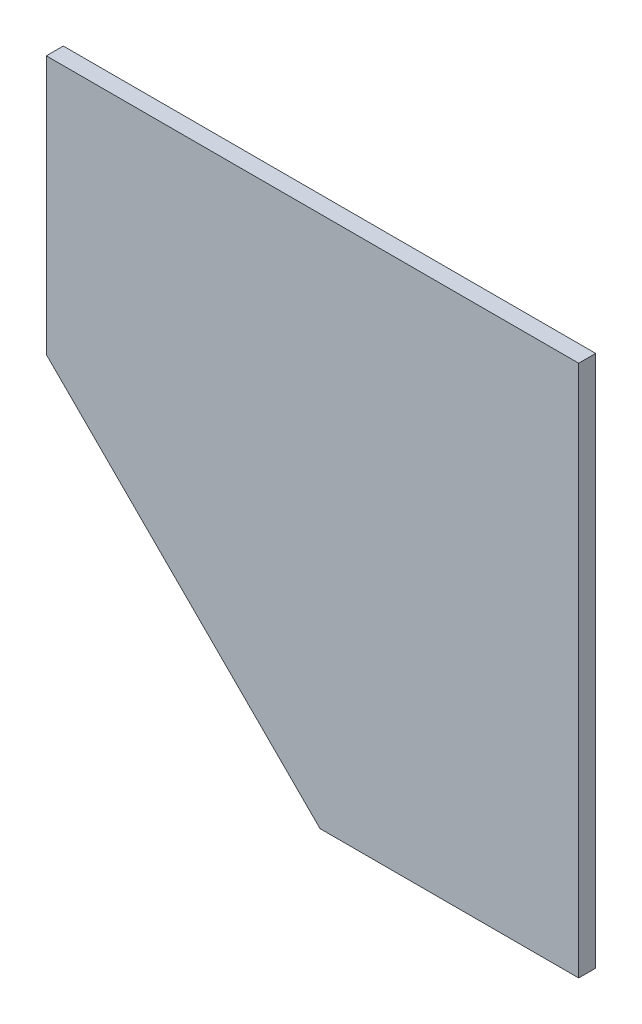
ISO-10303-21;
HEADER;
FILE_DESCRIPTION(('STEP AP214'),'2;1');
FILE_NAME('part.step','',(''),(''),'','','');
FILE_SCHEMA(('AUTOMOTIVE_DESIGN { 1 0 10303 214 1 1 1 1 }'));
ENDSEC;
DATA;
#1=APPLICATION_CONTEXT('core data for automotive mechanical design processes');
#2=APPLICATION_PROTOCOL_DEFINITION('international standard','automotive_design',2000,#1);
#3=PRODUCT_CONTEXT('',#1,'mechanical');
#4=PRODUCT('Part','Part','',(#3));
#5=PRODUCT_RELATED_PRODUCT_CATEGORY('part','',(#4));
#6=PRODUCT_DEFINITION_FORMATION('','',#4);
#7=PRODUCT_DEFINITION_CONTEXT('part definition',#1,'design');
#8=PRODUCT_DEFINITION('design','',#6,#7);
#9=PRODUCT_DEFINITION_SHAPE('','',#8);
#10=(LENGTH_UNIT() NAMED_UNIT(*) SI_UNIT(.MILLI.,.METRE.));
#11=(NAMED_UNIT(*) PLANE_ANGLE_UNIT() SI_UNIT($,.RADIAN.));
#12=(NAMED_UNIT(*) SI_UNIT($,.STERADIAN.) SOLID_ANGLE_UNIT());
#13=UNCERTAINTY_MEASURE_WITH_UNIT(LENGTH_MEASURE(1.E-05),#10,'distance_accuracy_value','');
#14=(GEOMETRIC_REPRESENTATION_CONTEXT(3) GLOBAL_UNCERTAINTY_ASSIGNED_CONTEXT((#13)) GLOBAL_UNIT_ASSIGNED_CONTEXT((#10,
#11,#12)) REPRESENTATION_CONTEXT('',''));
#15=CARTESIAN_POINT('',(0.,0.,0.));
#16=DIRECTION('',(0.,0.,1.));
#17=DIRECTION('',(1.,0.,0.));
#18=AXIS2_PLACEMENT_3D('',#15,#16,#17);
#19=CARTESIAN_POINT('',(-282.,-186.5,18.));
#20=DIRECTION('',(1.,0.,0.));
#21=DIRECTION('',(0.,1.,0.));
#22=AXIS2_PLACEMENT_3D('',#19,#20,#21);
#23=PLANE('',#22);
#24=DIRECTION('',(0.,-1.,0.));
#25=VECTOR('',#24,1.);
#26=CARTESIAN_POINT('',(-282.,-186.5,0.));
#27=LINE('',#26,#25);
#28=CARTESIAN_POINT('',(-282.,87.5,0.));
#29=VERTEX_POINT('',#28);
#30=CARTESIAN_POINT('',(-282.,-186.5,0.));
#31=VERTEX_POINT('',#30);
#32=EDGE_CURVE('E106',#29,#31,#27,.T.);
#33=ORIENTED_EDGE('',*,*,#32,.T.);
#34=DIRECTION('',(0.,0.,-1.));
#35=VECTOR('',#34,1.);
#36=CARTESIAN_POINT('',(-282.,-186.5,18.));
#37=LINE('',#36,#35);
#38=CARTESIAN_POINT('',(-282.,-186.5,18.));
#39=VERTEX_POINT('',#38);
#40=EDGE_CURVE('E11',#39,#31,#37,.T.);
#41=ORIENTED_EDGE('',*,*,#40,.F.);
#42=DIRECTION('',(0.,-1.,0.));
#43=VECTOR('',#42,1.);
#44=CARTESIAN_POINT('',(-282.,-186.5,18.));
#45=LINE('',#44,#43);
#46=CARTESIAN_POINT('',(-282.,87.5,18.));
#47=VERTEX_POINT('',#46);
#48=EDGE_CURVE('E114',#47,#39,#45,.T.);
#49=ORIENTED_EDGE('',*,*,#48,.F.);
#50=DIRECTION('',(0.,0.,-1.));
#51=VECTOR('',#50,1.);
#52=CARTESIAN_POINT('',(-282.,87.5,18.));
#53=LINE('',#52,#51);
#54=EDGE_CURVE('E102',#47,#29,#53,.T.);
#55=ORIENTED_EDGE('',*,*,#54,.T.);
#56=EDGE_LOOP('',(#33,#41,#49,#55));
#57=FACE_BOUND('',#56,.T.);
#58=ADVANCED_FACE('F32',(#57),#23,.F.);
#59=CARTESIAN_POINT('',(-282.,-186.5,18.));
#60=DIRECTION('',(0.707106781186548,0.707106781186547,0.));
#61=DIRECTION('',(-0.707106781186547,0.707106781186548,0.));
#62=AXIS2_PLACEMENT_3D('',#59,#60,#61);
#63=PLANE('',#62);
#64=DIRECTION('',(0.707106781186547,-0.707106781186548,0.));
#65=VECTOR('',#64,1.);
#66=CARTESIAN_POINT('',(-282.,-186.5,0.));
#67=LINE('',#66,#65);
#68=CARTESIAN_POINT('',(8.00000000000006,-476.5,0.));
#69=VERTEX_POINT('',#68);
#70=EDGE_CURVE('E109',#31,#69,#67,.T.);
#71=ORIENTED_EDGE('',*,*,#70,.T.);
#72=DIRECTION('',(0.,0.,-1.));
#73=VECTOR('',#72,1.);
#74=CARTESIAN_POINT('',(8.00000000000006,-476.5,18.));
#75=LINE('',#74,#73);
#76=CARTESIAN_POINT('',(8.00000000000006,-476.5,18.));
#77=VERTEX_POINT('',#76);
#78=EDGE_CURVE('E40',#77,#69,#75,.T.);
#79=ORIENTED_EDGE('',*,*,#78,.F.);
#80=DIRECTION('',(0.707106781186547,-0.707106781186548,0.));
#81=VECTOR('',#80,1.);
#82=CARTESIAN_POINT('',(-282.,-186.5,18.));
#83=LINE('',#82,#81);
#84=EDGE_CURVE('E82',#39,#77,#83,.T.);
#85=ORIENTED_EDGE('',*,*,#84,.F.);
#86=ORIENTED_EDGE('',*,*,#40,.T.);
#87=EDGE_LOOP('',(#71,#79,#85,#86));
#88=FACE_BOUND('',#87,.T.);
#89=ADVANCED_FACE('F133',(#88),#63,.F.);
#90=CARTESIAN_POINT('',(282.,-476.5,18.));
#91=DIRECTION('',(0.,1.,0.));
#92=DIRECTION('',(-1.,0.,0.));
#93=AXIS2_PLACEMENT_3D('',#90,#91,#92);
#94=PLANE('',#93);
#95=DIRECTION('',(1.,0.,0.));
#96=VECTOR('',#95,1.);
#97=CARTESIAN_POINT('',(282.,-476.5,0.));
#98=LINE('',#97,#96);
#99=CARTESIAN_POINT('',(282.,-476.5,0.));
#100=VERTEX_POINT('',#99);
#101=EDGE_CURVE('E97',#69,#100,#98,.T.);
#102=ORIENTED_EDGE('',*,*,#101,.T.);
#103=DIRECTION('',(0.,0.,-1.));
#104=VECTOR('',#103,1.);
#105=CARTESIAN_POINT('',(282.,-476.5,18.));
#106=LINE('',#105,#104);
#107=CARTESIAN_POINT('',(282.,-476.5,18.));
#108=VERTEX_POINT('',#107);
#109=EDGE_CURVE('E94',#108,#100,#106,.T.);
#110=ORIENTED_EDGE('',*,*,#109,.F.);
#111=DIRECTION('',(1.,0.,0.));
#112=VECTOR('',#111,1.);
#113=CARTESIAN_POINT('',(282.,-476.5,18.));
#114=LINE('',#113,#112);
#115=EDGE_CURVE('E86',#77,#108,#114,.T.);
#116=ORIENTED_EDGE('',*,*,#115,.F.);
#117=ORIENTED_EDGE('',*,*,#78,.T.);
#118=EDGE_LOOP('',(#102,#110,#116,#117));
#119=FACE_BOUND('',#118,.T.);
#120=ADVANCED_FACE('F95',(#119),#94,.F.);
#121=CARTESIAN_POINT('',(282.,-476.5,18.));
#122=DIRECTION('',(-1.,0.,0.));
#123=DIRECTION('',(0.,0.,1.));
#124=AXIS2_PLACEMENT_3D('',#121,#122,#123);
#125=PLANE('',#124);
#126=DIRECTION('',(0.,1.,0.));
#127=VECTOR('',#126,1.);
#128=CARTESIAN_POINT('',(282.,-476.5,0.));
#129=LINE('',#128,#127);
#130=CARTESIAN_POINT('',(282.,87.5000000000001,0.));
#131=VERTEX_POINT('',#130);
#132=EDGE_CURVE('E68',#100,#131,#129,.T.);
#133=ORIENTED_EDGE('',*,*,#132,.T.);
#134=DIRECTION('',(0.,0.,-1.));
#135=VECTOR('',#134,1.);
#136=CARTESIAN_POINT('',(282.,87.5000000000001,18.));
#137=LINE('',#136,#135);
#138=CARTESIAN_POINT('',(282.,87.5000000000001,18.));
#139=VERTEX_POINT('',#138);
#140=EDGE_CURVE('E98',#139,#131,#137,.T.);
#141=ORIENTED_EDGE('',*,*,#140,.F.);
#142=DIRECTION('',(0.,1.,0.));
#143=VECTOR('',#142,1.);
#144=CARTESIAN_POINT('',(282.,-476.5,18.));
#145=LINE('',#144,#143);
#146=EDGE_CURVE('E90',#108,#139,#145,.T.);
#147=ORIENTED_EDGE('',*,*,#146,.F.);
#148=ORIENTED_EDGE('',*,*,#109,.T.);
#149=EDGE_LOOP('',(#133,#141,#147,#148));
#150=FACE_BOUND('',#149,.T.);
#151=ADVANCED_FACE('F100',(#150),#125,.F.);
#152=CARTESIAN_POINT('',(282.,87.5000000000001,18.));
#153=DIRECTION('',(0.,-1.,0.));
#154=DIRECTION('',(1.,0.,0.));
#155=AXIS2_PLACEMENT_3D('',#152,#153,#154);
#156=PLANE('',#155);
#157=DIRECTION('',(-1.,0.,0.));
#158=VECTOR('',#157,1.);
#159=CARTESIAN_POINT('',(282.,87.5000000000001,0.));
#160=LINE('',#159,#158);
#161=EDGE_CURVE('E74',#131,#29,#160,.T.);
#162=ORIENTED_EDGE('',*,*,#161,.T.);
#163=ORIENTED_EDGE('',*,*,#54,.F.);
#164=DIRECTION('',(-1.,0.,0.));
#165=VECTOR('',#164,1.);
#166=CARTESIAN_POINT('',(282.,87.5000000000001,18.));
#167=LINE('',#166,#165);
#168=EDGE_CURVE('E48',#139,#47,#167,.T.);
#169=ORIENTED_EDGE('',*,*,#168,.F.);
#170=ORIENTED_EDGE('',*,*,#140,.T.);
#171=EDGE_LOOP('',(#162,#163,#169,#170));
#172=FACE_BOUND('',#171,.T.);
#173=ADVANCED_FACE('F122',(#172),#156,.F.);
#174=CARTESIAN_POINT('',(0.,0.,18.));
#175=DIRECTION('',(0.,0.,1.));
#176=DIRECTION('',(1.,0.,0.));
#177=AXIS2_PLACEMENT_3D('',#174,#175,#176);
#178=PLANE('',#177);
#179=ORIENTED_EDGE('',*,*,#48,.T.);
#180=ORIENTED_EDGE('',*,*,#84,.T.);
#181=ORIENTED_EDGE('',*,*,#115,.T.);
#182=ORIENTED_EDGE('',*,*,#146,.T.);
#183=ORIENTED_EDGE('',*,*,#168,.T.);
#184=EDGE_LOOP('',(#179,#180,#181,#182,#183));
#185=FACE_BOUND('',#184,.T.);
#186=ADVANCED_FACE('F88',(#185),#178,.T.);
#187=CARTESIAN_POINT('',(0.,0.,0.));
#188=DIRECTION('',(0.,0.,1.));
#189=DIRECTION('',(1.,0.,0.));
#190=AXIS2_PLACEMENT_3D('',#187,#188,#189);
#191=PLANE('',#190);
#192=ORIENTED_EDGE('',*,*,#32,.F.);
#193=ORIENTED_EDGE('',*,*,#161,.F.);
#194=ORIENTED_EDGE('',*,*,#132,.F.);
#195=ORIENTED_EDGE('',*,*,#101,.F.);
#196=ORIENTED_EDGE('',*,*,#70,.F.);
#197=EDGE_LOOP('',(#192,#193,#194,#195,#196));
#198=FACE_BOUND('',#197,.T.);
#199=ADVANCED_FACE('F118',(#198),#191,.F.);
#200=CLOSED_SHELL('',(#58,#89,#120,#151,#173,#186,#199));
#201=MANIFOLD_SOLID_BREP('B2',#200);
#202=ADVANCED_BREP_SHAPE_REPRESENTATION('',(#18,#201),#14);
#203=SHAPE_DEFINITION_REPRESENTATION(#9,#202);
ENDSEC;
END-ISO-10303-21;
